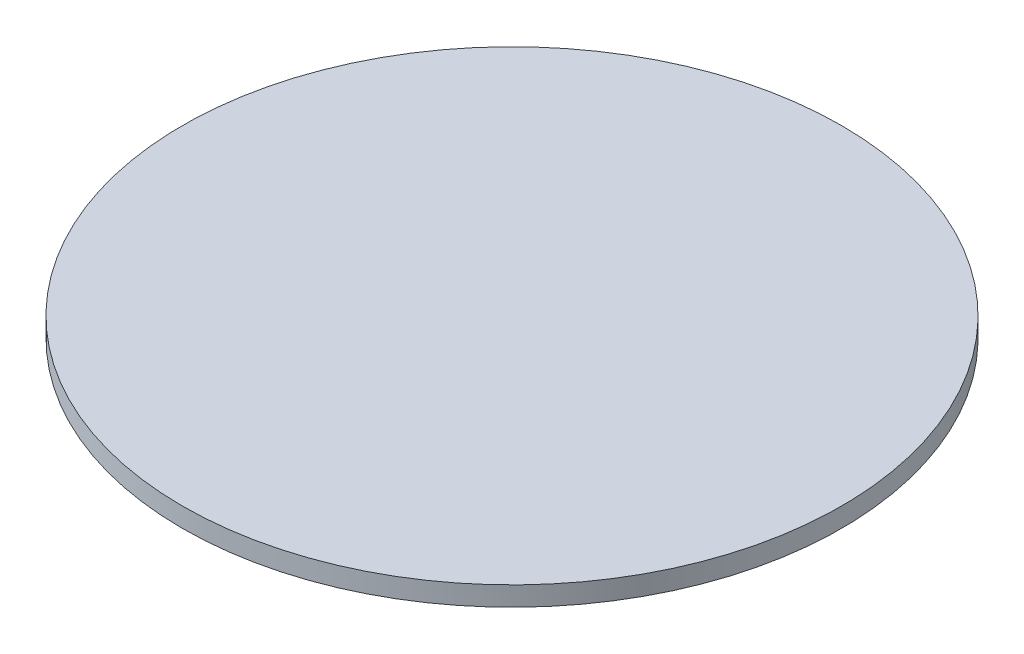
ISO-10303-21;
HEADER;
FILE_DESCRIPTION(('STEP AP214'),'2;1');
FILE_NAME('part.step','',(''),(''),'','','');
FILE_SCHEMA(('AUTOMOTIVE_DESIGN { 1 0 10303 214 1 1 1 1 }'));
ENDSEC;
DATA;
#1=APPLICATION_CONTEXT('core data for automotive mechanical design processes');
#2=APPLICATION_PROTOCOL_DEFINITION('international standard','automotive_design',2000,#1);
#3=PRODUCT_CONTEXT('',#1,'mechanical');
#4=PRODUCT('Part','Part','',(#3));
#5=PRODUCT_RELATED_PRODUCT_CATEGORY('part','',(#4));
#6=PRODUCT_DEFINITION_FORMATION('','',#4);
#7=PRODUCT_DEFINITION_CONTEXT('part definition',#1,'design');
#8=PRODUCT_DEFINITION('design','',#6,#7);
#9=PRODUCT_DEFINITION_SHAPE('','',#8);
#10=(LENGTH_UNIT() NAMED_UNIT(*) SI_UNIT(.MILLI.,.METRE.));
#11=(NAMED_UNIT(*) PLANE_ANGLE_UNIT() SI_UNIT($,.RADIAN.));
#12=(NAMED_UNIT(*) SI_UNIT($,.STERADIAN.) SOLID_ANGLE_UNIT());
#13=UNCERTAINTY_MEASURE_WITH_UNIT(LENGTH_MEASURE(1.E-05),#10,'distance_accuracy_value','');
#14=(GEOMETRIC_REPRESENTATION_CONTEXT(3) GLOBAL_UNCERTAINTY_ASSIGNED_CONTEXT((#13)) GLOBAL_UNIT_ASSIGNED_CONTEXT((#10,
#11,#12)) REPRESENTATION_CONTEXT('',''));
#15=CARTESIAN_POINT('',(0.,0.,0.));
#16=DIRECTION('',(0.,0.,1.));
#17=DIRECTION('',(1.,0.,0.));
#18=AXIS2_PLACEMENT_3D('',#15,#16,#17);
#19=CARTESIAN_POINT('',(8.81554645205922,3.,-5.82946180261568));
#20=DIRECTION('',(0.,-1.,0.));
#21=DIRECTION('',(0.,0.,-1.));
#22=AXIS2_PLACEMENT_3D('',#19,#20,#21);
#23=CYLINDRICAL_SURFACE('',#22,51.);
#24=CARTESIAN_POINT('',(8.81554645205922,3.,-5.82946180261568));
#25=DIRECTION('',(0.,1.,0.));
#26=DIRECTION('',(0.,0.,1.));
#27=AXIS2_PLACEMENT_3D('',#24,#25,#26);
#28=CIRCLE('',#27,51.);
#29=CARTESIAN_POINT('',(8.81554645205922,3.,45.1705381973843));
#30=VERTEX_POINT('',#29);
#31=EDGE_CURVE('E10',#30,#30,#28,.T.);
#32=ORIENTED_EDGE('',*,*,#31,.F.);
#33=EDGE_LOOP('',(#32));
#34=FACE_BOUND('',#33,.T.);
#35=CARTESIAN_POINT('',(8.81554645205922,0.,-5.82946180261568));
#36=DIRECTION('',(0.,1.,0.));
#37=DIRECTION('',(0.,0.,1.));
#38=AXIS2_PLACEMENT_3D('',#35,#36,#37);
#39=CIRCLE('',#38,51.);
#40=CARTESIAN_POINT('',(8.81554645205922,0.,45.1705381973843));
#41=VERTEX_POINT('',#40);
#42=EDGE_CURVE('E40',#41,#41,#39,.T.);
#43=ORIENTED_EDGE('',*,*,#42,.T.);
#44=EDGE_LOOP('',(#43));
#45=FACE_BOUND('',#44,.T.);
#46=ADVANCED_FACE('F37',(#34,#45),#23,.T.);
#47=CARTESIAN_POINT('',(8.81554645205922,3.,-5.82946180261568));
#48=DIRECTION('',(0.,1.,0.));
#49=DIRECTION('',(0.,0.,1.));
#50=AXIS2_PLACEMENT_3D('',#47,#48,#49);
#51=PLANE('',#50);
#52=ORIENTED_EDGE('',*,*,#31,.T.);
#53=EDGE_LOOP('',(#52));
#54=FACE_BOUND('',#53,.T.);
#55=ADVANCED_FACE('F54',(#54),#51,.T.);
#56=CARTESIAN_POINT('',(8.81554645205922,0.,-5.82946180261568));
#57=DIRECTION('',(0.,1.,0.));
#58=DIRECTION('',(0.,0.,1.));
#59=AXIS2_PLACEMENT_3D('',#56,#57,#58);
#60=PLANE('',#59);
#61=ORIENTED_EDGE('',*,*,#42,.F.);
#62=EDGE_LOOP('',(#61));
#63=FACE_BOUND('',#62,.T.);
#64=ADVANCED_FACE('F52',(#63),#60,.F.);
#65=CLOSED_SHELL('',(#46,#55,#64));
#66=MANIFOLD_SOLID_BREP('B2',#65);
#67=ADVANCED_BREP_SHAPE_REPRESENTATION('',(#18,#66),#14);
#68=SHAPE_DEFINITION_REPRESENTATION(#9,#67);
ENDSEC;
END-ISO-10303-21;
